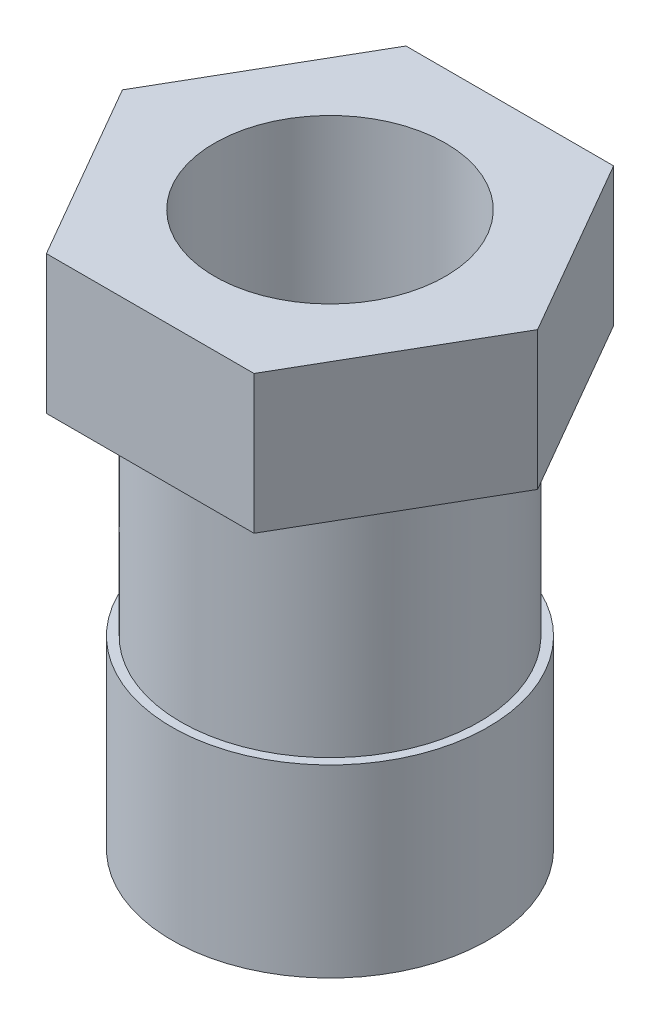
ISO-10303-21;
HEADER;
FILE_DESCRIPTION(('STEP AP214'),'2;1');
FILE_NAME('part.step','',(''),(''),'','','');
FILE_SCHEMA(('AUTOMOTIVE_DESIGN { 1 0 10303 214 1 1 1 1 }'));
ENDSEC;
DATA;
#1=APPLICATION_CONTEXT('core data for automotive mechanical design processes');
#2=APPLICATION_PROTOCOL_DEFINITION('international standard','automotive_design',2000,#1);
#3=PRODUCT_CONTEXT('',#1,'mechanical');
#4=PRODUCT('Part','Part','',(#3));
#5=PRODUCT_RELATED_PRODUCT_CATEGORY('part','',(#4));
#6=PRODUCT_DEFINITION_FORMATION('','',#4);
#7=PRODUCT_DEFINITION_CONTEXT('part definition',#1,'design');
#8=PRODUCT_DEFINITION('design','',#6,#7);
#9=PRODUCT_DEFINITION_SHAPE('','',#8);
#10=(LENGTH_UNIT() NAMED_UNIT(*) SI_UNIT(.MILLI.,.METRE.));
#11=(NAMED_UNIT(*) PLANE_ANGLE_UNIT() SI_UNIT($,.RADIAN.));
#12=(NAMED_UNIT(*) SI_UNIT($,.STERADIAN.) SOLID_ANGLE_UNIT());
#13=UNCERTAINTY_MEASURE_WITH_UNIT(LENGTH_MEASURE(1.E-05),#10,'distance_accuracy_value','');
#14=(GEOMETRIC_REPRESENTATION_CONTEXT(3) GLOBAL_UNCERTAINTY_ASSIGNED_CONTEXT((#13)) GLOBAL_UNIT_ASSIGNED_CONTEXT((#10,
#11,#12)) REPRESENTATION_CONTEXT('',''));
#15=CARTESIAN_POINT('',(0.,0.,0.));
#16=DIRECTION('',(0.,0.,1.));
#17=DIRECTION('',(1.,0.,0.));
#18=AXIS2_PLACEMENT_3D('',#15,#16,#17);
#19=CARTESIAN_POINT('',(0.,0.,0.));
#20=DIRECTION('',(0.,1.,0.));
#21=DIRECTION('',(0.,0.,1.));
#22=AXIS2_PLACEMENT_3D('',#19,#20,#21);
#23=PLANE('',#22);
#24=DIRECTION('',(0.499999999999995,0.,-0.866025403784441));
#25=VECTOR('',#24,1.);
#26=CARTESIAN_POINT('',(11.2500000000002,0.,19.4855715851497));
#27=LINE('',#26,#25);
#28=CARTESIAN_POINT('',(11.2500000000002,0.,19.4855715851497));
#29=VERTEX_POINT('',#28);
#30=CARTESIAN_POINT('',(22.5,0.,0.));
#31=VERTEX_POINT('',#30);
#32=EDGE_CURVE('E119',#29,#31,#27,.T.);
#33=ORIENTED_EDGE('',*,*,#32,.F.);
#34=DIRECTION('',(1.,0.,0.));
#35=VECTOR('',#34,1.);
#36=CARTESIAN_POINT('',(-11.2499999999998,0.,19.48557158515));
#37=LINE('',#36,#35);
#38=CARTESIAN_POINT('',(-11.2499999999998,0.,19.48557158515));
#39=VERTEX_POINT('',#38);
#40=EDGE_CURVE('E79',#39,#29,#37,.T.);
#41=ORIENTED_EDGE('',*,*,#40,.F.);
#42=DIRECTION('',(0.500000000000007,0.,0.866025403784434));
#43=VECTOR('',#42,1.);
#44=CARTESIAN_POINT('',(-22.5,0.,1.57116660247941E-13));
#45=LINE('',#44,#43);
#46=CARTESIAN_POINT('',(-22.5,0.,1.57116660247941E-13));
#47=VERTEX_POINT('',#46);
#48=EDGE_CURVE('E73',#47,#39,#45,.T.);
#49=ORIENTED_EDGE('',*,*,#48,.F.);
#50=DIRECTION('',(-0.499999999999995,0.,0.866025403784442));
#51=VECTOR('',#50,1.);
#52=CARTESIAN_POINT('',(-11.2500000000001,0.,-19.4855715851498));
#53=LINE('',#52,#51);
#54=CARTESIAN_POINT('',(-11.2500000000001,0.,-19.4855715851498));
#55=VERTEX_POINT('',#54);
#56=EDGE_CURVE('E109',#55,#47,#53,.T.);
#57=ORIENTED_EDGE('',*,*,#56,.F.);
#58=DIRECTION('',(-1.,0.,0.));
#59=VECTOR('',#58,1.);
#60=CARTESIAN_POINT('',(11.25,0.,-19.4855715851499));
#61=LINE('',#60,#59);
#62=CARTESIAN_POINT('',(11.25,0.,-19.4855715851499));
#63=VERTEX_POINT('',#62);
#64=EDGE_CURVE('E125',#63,#55,#61,.T.);
#65=ORIENTED_EDGE('',*,*,#64,.F.);
#66=DIRECTION('',(-0.500000000000001,0.,-0.866025403784438));
#67=VECTOR('',#66,1.);
#68=CARTESIAN_POINT('',(22.5,0.,0.));
#69=LINE('',#68,#67);
#70=EDGE_CURVE('E122',#31,#63,#69,.T.);
#71=ORIENTED_EDGE('',*,*,#70,.F.);
#72=EDGE_LOOP('',(#33,#41,#49,#57,#65,#71));
#73=FACE_BOUND('',#72,.T.);
#74=CARTESIAN_POINT('',(0.,0.,0.));
#75=DIRECTION('',(0.,1.,0.));
#76=DIRECTION('',(0.,0.,1.));
#77=AXIS2_PLACEMENT_3D('',#74,#75,#76);
#78=CIRCLE('',#77,16.1640409755687);
#79=CARTESIAN_POINT('',(0.,0.,16.1640409755687));
#80=VERTEX_POINT('',#79);
#81=EDGE_CURVE('E11',#80,#80,#78,.F.);
#82=ORIENTED_EDGE('',*,*,#81,.F.);
#83=EDGE_LOOP('',(#82));
#84=FACE_BOUND('',#83,.T.);
#85=ADVANCED_FACE('F33',(#73,#84),#23,.F.);
#86=CARTESIAN_POINT('',(11.2500000000002,15.,19.4855715851497));
#87=DIRECTION('',(-0.866025403784441,0.,-0.499999999999995));
#88=DIRECTION('',(-0.499999999999995,0.,0.866025403784442));
#89=AXIS2_PLACEMENT_3D('',#86,#87,#88);
#90=PLANE('',#89);
#91=ORIENTED_EDGE('',*,*,#32,.T.);
#92=DIRECTION('',(0.,-1.,0.));
#93=VECTOR('',#92,1.);
#94=CARTESIAN_POINT('',(22.5,15.,0.));
#95=LINE('',#94,#93);
#96=CARTESIAN_POINT('',(22.5,15.,0.));
#97=VERTEX_POINT('',#96);
#98=EDGE_CURVE('E42',#97,#31,#95,.T.);
#99=ORIENTED_EDGE('',*,*,#98,.F.);
#100=DIRECTION('',(0.499999999999995,0.,-0.866025403784441));
#101=VECTOR('',#100,1.);
#102=CARTESIAN_POINT('',(11.2500000000002,15.,19.4855715851497));
#103=LINE('',#102,#101);
#104=CARTESIAN_POINT('',(11.2500000000002,15.,19.4855715851497));
#105=VERTEX_POINT('',#104);
#106=EDGE_CURVE('E130',#105,#97,#103,.T.);
#107=ORIENTED_EDGE('',*,*,#106,.F.);
#108=DIRECTION('',(0.,-1.,0.));
#109=VECTOR('',#108,1.);
#110=CARTESIAN_POINT('',(11.2500000000002,15.,19.4855715851497));
#111=LINE('',#110,#109);
#112=EDGE_CURVE('E115',#105,#29,#111,.T.);
#113=ORIENTED_EDGE('',*,*,#112,.T.);
#114=EDGE_LOOP('',(#91,#99,#107,#113));
#115=FACE_BOUND('',#114,.T.);
#116=ADVANCED_FACE('F35',(#115),#90,.F.);
#117=CARTESIAN_POINT('',(22.5,15.,0.));
#118=DIRECTION('',(-0.866025403784438,0.,0.500000000000001));
#119=DIRECTION('',(0.500000000000001,0.,0.866025403784438));
#120=AXIS2_PLACEMENT_3D('',#117,#118,#119);
#121=PLANE('',#120);
#122=ORIENTED_EDGE('',*,*,#70,.T.);
#123=DIRECTION('',(0.,-1.,0.));
#124=VECTOR('',#123,1.);
#125=CARTESIAN_POINT('',(11.25,15.,-19.4855715851499));
#126=LINE('',#125,#124);
#127=CARTESIAN_POINT('',(11.25,15.,-19.4855715851499));
#128=VERTEX_POINT('',#127);
#129=EDGE_CURVE('E134',#128,#63,#126,.T.);
#130=ORIENTED_EDGE('',*,*,#129,.F.);
#131=DIRECTION('',(-0.500000000000001,0.,-0.866025403784438));
#132=VECTOR('',#131,1.);
#133=CARTESIAN_POINT('',(22.5,15.,0.));
#134=LINE('',#133,#132);
#135=EDGE_CURVE('E88',#97,#128,#134,.T.);
#136=ORIENTED_EDGE('',*,*,#135,.F.);
#137=ORIENTED_EDGE('',*,*,#98,.T.);
#138=EDGE_LOOP('',(#122,#130,#136,#137));
#139=FACE_BOUND('',#138,.T.);
#140=ADVANCED_FACE('F137',(#139),#121,.F.);
#141=CARTESIAN_POINT('',(11.25,15.,-19.4855715851499));
#142=DIRECTION('',(0.,0.,1.));
#143=DIRECTION('',(1.,0.,0.));
#144=AXIS2_PLACEMENT_3D('',#141,#142,#143);
#145=PLANE('',#144);
#146=ORIENTED_EDGE('',*,*,#64,.T.);
#147=DIRECTION('',(0.,-1.,0.));
#148=VECTOR('',#147,1.);
#149=CARTESIAN_POINT('',(-11.2500000000001,15.,-19.4855715851498));
#150=LINE('',#149,#148);
#151=CARTESIAN_POINT('',(-11.2500000000001,15.,-19.4855715851498));
#152=VERTEX_POINT('',#151);
#153=EDGE_CURVE('E110',#152,#55,#150,.T.);
#154=ORIENTED_EDGE('',*,*,#153,.F.);
#155=DIRECTION('',(-1.,0.,0.));
#156=VECTOR('',#155,1.);
#157=CARTESIAN_POINT('',(11.25,15.,-19.4855715851499));
#158=LINE('',#157,#156);
#159=EDGE_CURVE('E101',#128,#152,#158,.T.);
#160=ORIENTED_EDGE('',*,*,#159,.F.);
#161=ORIENTED_EDGE('',*,*,#129,.T.);
#162=EDGE_LOOP('',(#146,#154,#160,#161));
#163=FACE_BOUND('',#162,.T.);
#164=ADVANCED_FACE('F145',(#163),#145,.F.);
#165=CARTESIAN_POINT('',(-11.2500000000001,15.,-19.4855715851498));
#166=DIRECTION('',(0.866025403784442,0.,0.499999999999995));
#167=DIRECTION('',(0.499999999999995,0.,-0.866025403784442));
#168=AXIS2_PLACEMENT_3D('',#165,#166,#167);
#169=PLANE('',#168);
#170=ORIENTED_EDGE('',*,*,#56,.T.);
#171=DIRECTION('',(0.,-1.,0.));
#172=VECTOR('',#171,1.);
#173=CARTESIAN_POINT('',(-22.5,15.,1.57116660247941E-13));
#174=LINE('',#173,#172);
#175=CARTESIAN_POINT('',(-22.5,15.,1.57116660247941E-13));
#176=VERTEX_POINT('',#175);
#177=EDGE_CURVE('E106',#176,#47,#174,.T.);
#178=ORIENTED_EDGE('',*,*,#177,.F.);
#179=DIRECTION('',(-0.499999999999995,0.,0.866025403784442));
#180=VECTOR('',#179,1.);
#181=CARTESIAN_POINT('',(-11.2500000000001,15.,-19.4855715851498));
#182=LINE('',#181,#180);
#183=EDGE_CURVE('E95',#152,#176,#182,.T.);
#184=ORIENTED_EDGE('',*,*,#183,.F.);
#185=ORIENTED_EDGE('',*,*,#153,.T.);
#186=EDGE_LOOP('',(#170,#178,#184,#185));
#187=FACE_BOUND('',#186,.T.);
#188=ADVANCED_FACE('F107',(#187),#169,.F.);
#189=CARTESIAN_POINT('',(-22.5,15.,1.57116660247941E-13));
#190=DIRECTION('',(0.866025403784435,0.,-0.500000000000007));
#191=DIRECTION('',(-0.500000000000007,0.,-0.866025403784435));
#192=AXIS2_PLACEMENT_3D('',#189,#190,#191);
#193=PLANE('',#192);
#194=ORIENTED_EDGE('',*,*,#48,.T.);
#195=DIRECTION('',(0.,-1.,0.));
#196=VECTOR('',#195,1.);
#197=CARTESIAN_POINT('',(-11.2499999999998,15.,19.48557158515));
#198=LINE('',#197,#196);
#199=CARTESIAN_POINT('',(-11.2499999999998,15.,19.48557158515));
#200=VERTEX_POINT('',#199);
#201=EDGE_CURVE('E111',#200,#39,#198,.T.);
#202=ORIENTED_EDGE('',*,*,#201,.F.);
#203=DIRECTION('',(0.500000000000007,0.,0.866025403784434));
#204=VECTOR('',#203,1.);
#205=CARTESIAN_POINT('',(-22.5,15.,1.57116660247941E-13));
#206=LINE('',#205,#204);
#207=EDGE_CURVE('E99',#176,#200,#206,.T.);
#208=ORIENTED_EDGE('',*,*,#207,.F.);
#209=ORIENTED_EDGE('',*,*,#177,.T.);
#210=EDGE_LOOP('',(#194,#202,#208,#209));
#211=FACE_BOUND('',#210,.T.);
#212=ADVANCED_FACE('F113',(#211),#193,.F.);
#213=CARTESIAN_POINT('',(-11.2499999999998,15.,19.48557158515));
#214=DIRECTION('',(0.,0.,-1.));
#215=DIRECTION('',(-1.,0.,0.));
#216=AXIS2_PLACEMENT_3D('',#213,#214,#215);
#217=PLANE('',#216);
#218=ORIENTED_EDGE('',*,*,#40,.T.);
#219=ORIENTED_EDGE('',*,*,#112,.F.);
#220=DIRECTION('',(1.,0.,0.));
#221=VECTOR('',#220,1.);
#222=CARTESIAN_POINT('',(-11.2499999999998,15.,19.48557158515));
#223=LINE('',#222,#221);
#224=EDGE_CURVE('E50',#200,#105,#223,.T.);
#225=ORIENTED_EDGE('',*,*,#224,.F.);
#226=ORIENTED_EDGE('',*,*,#201,.T.);
#227=EDGE_LOOP('',(#218,#219,#225,#226));
#228=FACE_BOUND('',#227,.T.);
#229=ADVANCED_FACE('F201',(#228),#217,.F.);
#230=CARTESIAN_POINT('',(0.,15.,0.));
#231=DIRECTION('',(0.,1.,0.));
#232=DIRECTION('',(0.,0.,1.));
#233=AXIS2_PLACEMENT_3D('',#230,#231,#232);
#234=PLANE('',#233);
#235=CARTESIAN_POINT('',(0.,15.,0.));
#236=DIRECTION('',(0.,-1.,0.));
#237=DIRECTION('',(0.,0.,-1.));
#238=AXIS2_PLACEMENT_3D('',#235,#236,#237);
#239=CIRCLE('',#238,12.5140757707783);
#240=CARTESIAN_POINT('',(0.,15.,-12.5140757707783));
#241=VERTEX_POINT('',#240);
#242=EDGE_CURVE('E155',#241,#241,#239,.T.);
#243=ORIENTED_EDGE('',*,*,#242,.T.);
#244=EDGE_LOOP('',(#243));
#245=FACE_BOUND('',#244,.T.);
#246=ORIENTED_EDGE('',*,*,#106,.T.);
#247=ORIENTED_EDGE('',*,*,#135,.T.);
#248=ORIENTED_EDGE('',*,*,#159,.T.);
#249=ORIENTED_EDGE('',*,*,#183,.T.);
#250=ORIENTED_EDGE('',*,*,#207,.T.);
#251=ORIENTED_EDGE('',*,*,#224,.T.);
#252=EDGE_LOOP('',(#246,#247,#248,#249,#250,#251));
#253=FACE_BOUND('',#252,.T.);
#254=ADVANCED_FACE('F97',(#245,#253),#234,.T.);
#255=CARTESIAN_POINT('',(0.,-25.,0.));
#256=DIRECTION('',(0.,1.,0.));
#257=DIRECTION('',(0.,0.,1.));
#258=AXIS2_PLACEMENT_3D('',#255,#256,#257);
#259=CYLINDRICAL_SURFACE('',#258,16.1640409755687);
#260=CARTESIAN_POINT('',(0.,-25.,0.));
#261=DIRECTION('',(0.,-1.,0.));
#262=DIRECTION('',(0.,0.,-1.));
#263=AXIS2_PLACEMENT_3D('',#260,#261,#262);
#264=CIRCLE('',#263,16.1640409755687);
#265=CARTESIAN_POINT('',(0.,-25.,-16.1640409755687));
#266=VERTEX_POINT('',#265);
#267=EDGE_CURVE('E123',#266,#266,#264,.T.);
#268=ORIENTED_EDGE('',*,*,#267,.F.);
#269=EDGE_LOOP('',(#268));
#270=FACE_BOUND('',#269,.T.);
#271=ORIENTED_EDGE('',*,*,#81,.T.);
#272=EDGE_LOOP('',(#271));
#273=FACE_BOUND('',#272,.T.);
#274=ADVANCED_FACE('F186',(#270,#273),#259,.T.);
#275=CARTESIAN_POINT('',(0.,-25.,0.));
#276=DIRECTION('',(0.,-1.,0.));
#277=DIRECTION('',(0.,0.,-1.));
#278=AXIS2_PLACEMENT_3D('',#275,#276,#277);
#279=PLANE('',#278);
#280=CARTESIAN_POINT('',(0.,-25.,0.));
#281=DIRECTION('',(0.,-1.,0.));
#282=DIRECTION('',(0.,0.,-1.));
#283=AXIS2_PLACEMENT_3D('',#280,#281,#282);
#284=CIRCLE('',#283,17.134212928914);
#285=CARTESIAN_POINT('',(0.,-25.,-17.134212928914));
#286=VERTEX_POINT('',#285);
#287=EDGE_CURVE('E152',#286,#286,#284,.T.);
#288=ORIENTED_EDGE('',*,*,#287,.F.);
#289=EDGE_LOOP('',(#288));
#290=FACE_BOUND('',#289,.T.);
#291=ORIENTED_EDGE('',*,*,#267,.T.);
#292=EDGE_LOOP('',(#291));
#293=FACE_BOUND('',#292,.T.);
#294=ADVANCED_FACE('F180',(#290,#293),#279,.F.);
#295=CARTESIAN_POINT('',(0.,-45.,0.));
#296=DIRECTION('',(0.,1.,0.));
#297=DIRECTION('',(0.,0.,1.));
#298=AXIS2_PLACEMENT_3D('',#295,#296,#297);
#299=CYLINDRICAL_SURFACE('',#298,17.134212928914);
#300=CARTESIAN_POINT('',(0.,-45.,0.));
#301=DIRECTION('',(0.,-1.,0.));
#302=DIRECTION('',(0.,0.,-1.));
#303=AXIS2_PLACEMENT_3D('',#300,#301,#302);
#304=CIRCLE('',#303,17.134212928914);
#305=CARTESIAN_POINT('',(0.,-45.,-17.134212928914));
#306=VERTEX_POINT('',#305);
#307=EDGE_CURVE('E151',#306,#306,#304,.T.);
#308=ORIENTED_EDGE('',*,*,#307,.F.);
#309=EDGE_LOOP('',(#308));
#310=FACE_BOUND('',#309,.T.);
#311=ORIENTED_EDGE('',*,*,#287,.T.);
#312=EDGE_LOOP('',(#311));
#313=FACE_BOUND('',#312,.T.);
#314=ADVANCED_FACE('F174',(#310,#313),#299,.T.);
#315=CARTESIAN_POINT('',(0.,-45.,0.));
#316=DIRECTION('',(0.,-1.,0.));
#317=DIRECTION('',(0.,0.,-1.));
#318=AXIS2_PLACEMENT_3D('',#315,#316,#317);
#319=PLANE('',#318);
#320=CARTESIAN_POINT('',(0.,-45.,0.));
#321=DIRECTION('',(0.,-1.,0.));
#322=DIRECTION('',(0.,0.,-1.));
#323=AXIS2_PLACEMENT_3D('',#320,#321,#322);
#324=CIRCLE('',#323,12.5140757707783);
#325=CARTESIAN_POINT('',(0.,-45.,-12.5140757707783));
#326=VERTEX_POINT('',#325);
#327=EDGE_CURVE('E158',#326,#326,#324,.T.);
#328=ORIENTED_EDGE('',*,*,#327,.F.);
#329=EDGE_LOOP('',(#328));
#330=FACE_BOUND('',#329,.T.);
#331=ORIENTED_EDGE('',*,*,#307,.T.);
#332=EDGE_LOOP('',(#331));
#333=FACE_BOUND('',#332,.T.);
#334=ADVANCED_FACE('F168',(#330,#333),#319,.T.);
#335=CARTESIAN_POINT('',(0.,15.,0.));
#336=DIRECTION('',(0.,-1.,0.));
#337=DIRECTION('',(0.,0.,-1.));
#338=AXIS2_PLACEMENT_3D('',#335,#336,#337);
#339=CYLINDRICAL_SURFACE('',#338,12.5140757707783);
#340=ORIENTED_EDGE('',*,*,#242,.F.);
#341=EDGE_LOOP('',(#340));
#342=FACE_BOUND('',#341,.T.);
#343=ORIENTED_EDGE('',*,*,#327,.T.);
#344=EDGE_LOOP('',(#343));
#345=FACE_BOUND('',#344,.T.);
#346=ADVANCED_FACE('F165',(#342,#345),#339,.F.);
#347=CLOSED_SHELL('',(#85,#116,#140,#164,#188,#212,#229,#254,#274,#294,#314,#334,#346));
#348=MANIFOLD_SOLID_BREP('B2',#347);
#349=ADVANCED_BREP_SHAPE_REPRESENTATION('',(#18,#348),#14);
#350=SHAPE_DEFINITION_REPRESENTATION(#9,#349);
ENDSEC;
END-ISO-10303-21;
